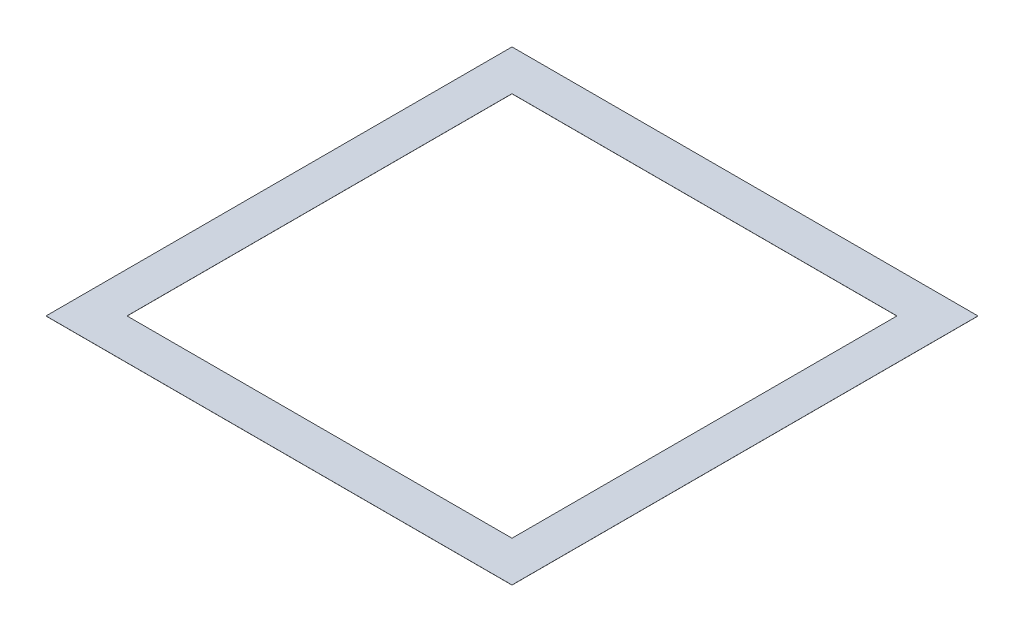
ISO-10303-21;
HEADER;
FILE_DESCRIPTION(('STEP AP214'),'2;1');
FILE_NAME('part.step','',(''),(''),'','','');
FILE_SCHEMA(('AUTOMOTIVE_DESIGN { 1 0 10303 214 1 1 1 1 }'));
ENDSEC;
DATA;
#1=APPLICATION_CONTEXT('core data for automotive mechanical design processes');
#2=APPLICATION_PROTOCOL_DEFINITION('international standard','automotive_design',2000,#1);
#3=PRODUCT_CONTEXT('',#1,'mechanical');
#4=PRODUCT('Part','Part','',(#3));
#5=PRODUCT_RELATED_PRODUCT_CATEGORY('part','',(#4));
#6=PRODUCT_DEFINITION_FORMATION('','',#4);
#7=PRODUCT_DEFINITION_CONTEXT('part definition',#1,'design');
#8=PRODUCT_DEFINITION('design','',#6,#7);
#9=PRODUCT_DEFINITION_SHAPE('','',#8);
#10=(LENGTH_UNIT() NAMED_UNIT(*) SI_UNIT(.MILLI.,.METRE.));
#11=(NAMED_UNIT(*) PLANE_ANGLE_UNIT() SI_UNIT($,.RADIAN.));
#12=(NAMED_UNIT(*) SI_UNIT($,.STERADIAN.) SOLID_ANGLE_UNIT());
#13=UNCERTAINTY_MEASURE_WITH_UNIT(LENGTH_MEASURE(1.E-05),#10,'distance_accuracy_value','');
#14=(GEOMETRIC_REPRESENTATION_CONTEXT(3) GLOBAL_UNCERTAINTY_ASSIGNED_CONTEXT((#13)) GLOBAL_UNIT_ASSIGNED_CONTEXT((#10,
#11,#12)) REPRESENTATION_CONTEXT('',''));
#15=CARTESIAN_POINT('',(0.,0.,0.));
#16=DIRECTION('',(0.,0.,1.));
#17=DIRECTION('',(1.,0.,0.));
#18=AXIS2_PLACEMENT_3D('',#15,#16,#17);
#19=CARTESIAN_POINT('',(0.,0.,0.));
#20=DIRECTION('',(0.,1.,0.));
#21=DIRECTION('',(0.,0.,1.));
#22=AXIS2_PLACEMENT_3D('',#19,#20,#21);
#23=PLANE('',#22);
#24=DIRECTION('',(1.,0.,0.));
#25=VECTOR('',#24,1.);
#26=CARTESIAN_POINT('',(241.3,0.,-241.3));
#27=LINE('',#26,#25);
#28=CARTESIAN_POINT('',(-241.3,0.,-241.3));
#29=VERTEX_POINT('',#28);
#30=CARTESIAN_POINT('',(241.3,0.,-241.3));
#31=VERTEX_POINT('',#30);
#32=EDGE_CURVE('E109',#29,#31,#27,.T.);
#33=ORIENTED_EDGE('',*,*,#32,.F.);
#34=DIRECTION('',(0.,0.,-1.));
#35=VECTOR('',#34,1.);
#36=CARTESIAN_POINT('',(-241.3,0.,241.3));
#37=LINE('',#36,#35);
#38=CARTESIAN_POINT('',(-241.3,0.,241.3));
#39=VERTEX_POINT('',#38);
#40=EDGE_CURVE('E123',#39,#29,#37,.T.);
#41=ORIENTED_EDGE('',*,*,#40,.F.);
#42=DIRECTION('',(-1.,0.,0.));
#43=VECTOR('',#42,1.);
#44=CARTESIAN_POINT('',(241.3,0.,241.3));
#45=LINE('',#44,#43);
#46=CARTESIAN_POINT('',(241.3,0.,241.3));
#47=VERTEX_POINT('',#46);
#48=EDGE_CURVE('E118',#47,#39,#45,.T.);
#49=ORIENTED_EDGE('',*,*,#48,.F.);
#50=DIRECTION('',(0.,0.,1.));
#51=VECTOR('',#50,1.);
#52=CARTESIAN_POINT('',(241.3,0.,241.3));
#53=LINE('',#52,#51);
#54=EDGE_CURVE('E112',#31,#47,#53,.T.);
#55=ORIENTED_EDGE('',*,*,#54,.F.);
#56=EDGE_LOOP('',(#33,#41,#49,#55));
#57=FACE_BOUND('',#56,.T.);
#58=DIRECTION('',(1.,0.,0.));
#59=VECTOR('',#58,1.);
#60=CARTESIAN_POINT('',(292.1,0.,-292.1));
#61=LINE('',#60,#59);
#62=CARTESIAN_POINT('',(-292.1,0.,-292.1));
#63=VERTEX_POINT('',#62);
#64=CARTESIAN_POINT('',(292.1,0.,-292.1));
#65=VERTEX_POINT('',#64);
#66=EDGE_CURVE('E107',#63,#65,#61,.T.);
#67=ORIENTED_EDGE('',*,*,#66,.T.);
#68=DIRECTION('',(0.,0.,1.));
#69=VECTOR('',#68,1.);
#70=CARTESIAN_POINT('',(292.1,0.,292.1));
#71=LINE('',#70,#69);
#72=CARTESIAN_POINT('',(292.1,0.,292.1));
#73=VERTEX_POINT('',#72);
#74=EDGE_CURVE('E93',#65,#73,#71,.T.);
#75=ORIENTED_EDGE('',*,*,#74,.T.);
#76=DIRECTION('',(-1.,0.,0.));
#77=VECTOR('',#76,1.);
#78=CARTESIAN_POINT('',(292.1,0.,292.1));
#79=LINE('',#78,#77);
#80=CARTESIAN_POINT('',(-292.1,0.,292.1));
#81=VERTEX_POINT('',#80);
#82=EDGE_CURVE('E80',#73,#81,#79,.T.);
#83=ORIENTED_EDGE('',*,*,#82,.T.);
#84=DIRECTION('',(0.,0.,-1.));
#85=VECTOR('',#84,1.);
#86=CARTESIAN_POINT('',(-292.1,0.,292.1));
#87=LINE('',#86,#85);
#88=EDGE_CURVE('E20',#81,#63,#87,.T.);
#89=ORIENTED_EDGE('',*,*,#88,.T.);
#90=EDGE_LOOP('',(#67,#75,#83,#89));
#91=FACE_BOUND('',#90,.T.);
#92=ADVANCED_FACE('F17',(#57,#91),#23,.F.);
#93=CARTESIAN_POINT('',(-292.1,0.127,292.1));
#94=DIRECTION('',(1.,0.,0.));
#95=DIRECTION('',(0.,0.,-1.));
#96=AXIS2_PLACEMENT_3D('',#93,#94,#95);
#97=PLANE('',#96);
#98=DIRECTION('',(0.,1.,0.));
#99=VECTOR('',#98,1.);
#100=CARTESIAN_POINT('',(-292.1,0.127,292.1));
#101=LINE('',#100,#99);
#102=CARTESIAN_POINT('',(-292.1,0.127,292.1));
#103=VERTEX_POINT('',#102);
#104=EDGE_CURVE('E86',#81,#103,#101,.T.);
#105=ORIENTED_EDGE('',*,*,#104,.T.);
#106=DIRECTION('',(0.,0.,1.));
#107=VECTOR('',#106,1.);
#108=CARTESIAN_POINT('',(-292.1,0.127,0.));
#109=LINE('',#108,#107);
#110=CARTESIAN_POINT('',(-292.1,0.127,-292.1));
#111=VERTEX_POINT('',#110);
#112=EDGE_CURVE('E130',#111,#103,#109,.T.);
#113=ORIENTED_EDGE('',*,*,#112,.F.);
#114=DIRECTION('',(0.,1.,0.));
#115=VECTOR('',#114,1.);
#116=CARTESIAN_POINT('',(-292.1,0.127,-292.1));
#117=LINE('',#116,#115);
#118=EDGE_CURVE('E89',#111,#63,#117,.F.);
#119=ORIENTED_EDGE('',*,*,#118,.T.);
#120=ORIENTED_EDGE('',*,*,#88,.F.);
#121=EDGE_LOOP('',(#105,#113,#119,#120));
#122=FACE_BOUND('',#121,.T.);
#123=ADVANCED_FACE('F85',(#122),#97,.F.);
#124=CARTESIAN_POINT('',(292.1,0.127,292.1));
#125=DIRECTION('',(0.,0.,-1.));
#126=DIRECTION('',(-1.,0.,0.));
#127=AXIS2_PLACEMENT_3D('',#124,#125,#126);
#128=PLANE('',#127);
#129=DIRECTION('',(0.,1.,0.));
#130=VECTOR('',#129,1.);
#131=CARTESIAN_POINT('',(292.1,0.127,292.1));
#132=LINE('',#131,#130);
#133=CARTESIAN_POINT('',(292.1,0.127,292.1));
#134=VERTEX_POINT('',#133);
#135=EDGE_CURVE('E95',#73,#134,#132,.T.);
#136=ORIENTED_EDGE('',*,*,#135,.T.);
#137=DIRECTION('',(1.,0.,0.));
#138=VECTOR('',#137,1.);
#139=CARTESIAN_POINT('',(0.,0.127,292.1));
#140=LINE('',#139,#138);
#141=EDGE_CURVE('E99',#103,#134,#140,.T.);
#142=ORIENTED_EDGE('',*,*,#141,.F.);
#143=ORIENTED_EDGE('',*,*,#104,.F.);
#144=ORIENTED_EDGE('',*,*,#82,.F.);
#145=EDGE_LOOP('',(#136,#142,#143,#144));
#146=FACE_BOUND('',#145,.T.);
#147=ADVANCED_FACE('F97',(#146),#128,.F.);
#148=CARTESIAN_POINT('',(292.1,0.127,292.1));
#149=DIRECTION('',(-1.,0.,0.));
#150=DIRECTION('',(0.,0.,1.));
#151=AXIS2_PLACEMENT_3D('',#148,#149,#150);
#152=PLANE('',#151);
#153=DIRECTION('',(0.,1.,0.));
#154=VECTOR('',#153,1.);
#155=CARTESIAN_POINT('',(292.1,0.127,-292.1));
#156=LINE('',#155,#154);
#157=CARTESIAN_POINT('',(292.1,0.127,-292.1));
#158=VERTEX_POINT('',#157);
#159=EDGE_CURVE('E104',#65,#158,#156,.T.);
#160=ORIENTED_EDGE('',*,*,#159,.T.);
#161=DIRECTION('',(0.,0.,1.));
#162=VECTOR('',#161,1.);
#163=CARTESIAN_POINT('',(292.1,0.127,0.));
#164=LINE('',#163,#162);
#165=EDGE_CURVE('E133',#134,#158,#164,.F.);
#166=ORIENTED_EDGE('',*,*,#165,.F.);
#167=ORIENTED_EDGE('',*,*,#135,.F.);
#168=ORIENTED_EDGE('',*,*,#74,.F.);
#169=EDGE_LOOP('',(#160,#166,#167,#168));
#170=FACE_BOUND('',#169,.T.);
#171=ADVANCED_FACE('F176',(#170),#152,.F.);
#172=CARTESIAN_POINT('',(292.1,0.127,-292.1));
#173=DIRECTION('',(0.,0.,1.));
#174=DIRECTION('',(1.,0.,0.));
#175=AXIS2_PLACEMENT_3D('',#172,#173,#174);
#176=PLANE('',#175);
#177=ORIENTED_EDGE('',*,*,#118,.F.);
#178=DIRECTION('',(1.,0.,0.));
#179=VECTOR('',#178,1.);
#180=CARTESIAN_POINT('',(0.,0.127,-292.1));
#181=LINE('',#180,#179);
#182=EDGE_CURVE('E136',#158,#111,#181,.F.);
#183=ORIENTED_EDGE('',*,*,#182,.F.);
#184=ORIENTED_EDGE('',*,*,#159,.F.);
#185=ORIENTED_EDGE('',*,*,#66,.F.);
#186=EDGE_LOOP('',(#177,#183,#184,#185));
#187=FACE_BOUND('',#186,.T.);
#188=ADVANCED_FACE('F173',(#187),#176,.F.);
#189=CARTESIAN_POINT('',(241.3,0.127,-241.3));
#190=DIRECTION('',(0.,0.,1.));
#191=DIRECTION('',(1.,0.,0.));
#192=AXIS2_PLACEMENT_3D('',#189,#190,#191);
#193=PLANE('',#192);
#194=DIRECTION('',(1.,0.,0.));
#195=VECTOR('',#194,1.);
#196=CARTESIAN_POINT('',(0.,0.127,-241.3));
#197=LINE('',#196,#195);
#198=CARTESIAN_POINT('',(-241.3,0.127,-241.3));
#199=VERTEX_POINT('',#198);
#200=CARTESIAN_POINT('',(241.3,0.127,-241.3));
#201=VERTEX_POINT('',#200);
#202=EDGE_CURVE('E139',#199,#201,#197,.T.);
#203=ORIENTED_EDGE('',*,*,#202,.F.);
#204=DIRECTION('',(0.,1.,0.));
#205=VECTOR('',#204,1.);
#206=CARTESIAN_POINT('',(-241.3,0.127,-241.3));
#207=LINE('',#206,#205);
#208=EDGE_CURVE('E126',#29,#199,#207,.T.);
#209=ORIENTED_EDGE('',*,*,#208,.F.);
#210=ORIENTED_EDGE('',*,*,#32,.T.);
#211=DIRECTION('',(0.,1.,0.));
#212=VECTOR('',#211,1.);
#213=CARTESIAN_POINT('',(241.3,0.127,-241.3));
#214=LINE('',#213,#212);
#215=EDGE_CURVE('E115',#201,#31,#214,.F.);
#216=ORIENTED_EDGE('',*,*,#215,.F.);
#217=EDGE_LOOP('',(#203,#209,#210,#216));
#218=FACE_BOUND('',#217,.T.);
#219=ADVANCED_FACE('F156',(#218),#193,.T.);
#220=CARTESIAN_POINT('',(241.3,0.127,241.3));
#221=DIRECTION('',(-1.,0.,0.));
#222=DIRECTION('',(0.,0.,1.));
#223=AXIS2_PLACEMENT_3D('',#220,#221,#222);
#224=PLANE('',#223);
#225=DIRECTION('',(0.,0.,1.));
#226=VECTOR('',#225,1.);
#227=CARTESIAN_POINT('',(241.3,0.127,0.));
#228=LINE('',#227,#226);
#229=CARTESIAN_POINT('',(241.3,0.127,241.3));
#230=VERTEX_POINT('',#229);
#231=EDGE_CURVE('E142',#201,#230,#228,.T.);
#232=ORIENTED_EDGE('',*,*,#231,.F.);
#233=ORIENTED_EDGE('',*,*,#215,.T.);
#234=ORIENTED_EDGE('',*,*,#54,.T.);
#235=DIRECTION('',(0.,1.,0.));
#236=VECTOR('',#235,1.);
#237=CARTESIAN_POINT('',(241.3,0.127,241.3));
#238=LINE('',#237,#236);
#239=EDGE_CURVE('E120',#230,#47,#238,.F.);
#240=ORIENTED_EDGE('',*,*,#239,.F.);
#241=EDGE_LOOP('',(#232,#233,#234,#240));
#242=FACE_BOUND('',#241,.T.);
#243=ADVANCED_FACE('F152',(#242),#224,.T.);
#244=CARTESIAN_POINT('',(241.3,0.127,241.3));
#245=DIRECTION('',(0.,0.,-1.));
#246=DIRECTION('',(-1.,0.,0.));
#247=AXIS2_PLACEMENT_3D('',#244,#245,#246);
#248=PLANE('',#247);
#249=DIRECTION('',(1.,0.,0.));
#250=VECTOR('',#249,1.);
#251=CARTESIAN_POINT('',(0.,0.127,241.3));
#252=LINE('',#251,#250);
#253=CARTESIAN_POINT('',(-241.3,0.127,241.3));
#254=VERTEX_POINT('',#253);
#255=EDGE_CURVE('E26',#230,#254,#252,.F.);
#256=ORIENTED_EDGE('',*,*,#255,.F.);
#257=ORIENTED_EDGE('',*,*,#239,.T.);
#258=ORIENTED_EDGE('',*,*,#48,.T.);
#259=DIRECTION('',(0.,1.,0.));
#260=VECTOR('',#259,1.);
#261=CARTESIAN_POINT('',(-241.3,0.127,241.3));
#262=LINE('',#261,#260);
#263=EDGE_CURVE('E35',#254,#39,#262,.F.);
#264=ORIENTED_EDGE('',*,*,#263,.F.);
#265=EDGE_LOOP('',(#256,#257,#258,#264));
#266=FACE_BOUND('',#265,.T.);
#267=ADVANCED_FACE('F150',(#266),#248,.T.);
#268=CARTESIAN_POINT('',(-241.3,0.127,241.3));
#269=DIRECTION('',(1.,0.,0.));
#270=DIRECTION('',(0.,0.,-1.));
#271=AXIS2_PLACEMENT_3D('',#268,#269,#270);
#272=PLANE('',#271);
#273=DIRECTION('',(0.,0.,1.));
#274=VECTOR('',#273,1.);
#275=CARTESIAN_POINT('',(-241.3,0.127,0.));
#276=LINE('',#275,#274);
#277=EDGE_CURVE('E11',#254,#199,#276,.F.);
#278=ORIENTED_EDGE('',*,*,#277,.F.);
#279=ORIENTED_EDGE('',*,*,#263,.T.);
#280=ORIENTED_EDGE('',*,*,#40,.T.);
#281=ORIENTED_EDGE('',*,*,#208,.T.);
#282=EDGE_LOOP('',(#278,#279,#280,#281));
#283=FACE_BOUND('',#282,.T.);
#284=ADVANCED_FACE('F158',(#283),#272,.T.);
#285=CARTESIAN_POINT('',(0.,0.127,0.));
#286=DIRECTION('',(0.,1.,0.));
#287=DIRECTION('',(0.,0.,1.));
#288=AXIS2_PLACEMENT_3D('',#285,#286,#287);
#289=PLANE('',#288);
#290=ORIENTED_EDGE('',*,*,#255,.T.);
#291=ORIENTED_EDGE('',*,*,#277,.T.);
#292=ORIENTED_EDGE('',*,*,#202,.T.);
#293=ORIENTED_EDGE('',*,*,#231,.T.);
#294=EDGE_LOOP('',(#290,#291,#292,#293));
#295=FACE_BOUND('',#294,.T.);
#296=ORIENTED_EDGE('',*,*,#165,.T.);
#297=ORIENTED_EDGE('',*,*,#182,.T.);
#298=ORIENTED_EDGE('',*,*,#112,.T.);
#299=ORIENTED_EDGE('',*,*,#141,.T.);
#300=EDGE_LOOP('',(#296,#297,#298,#299));
#301=FACE_BOUND('',#300,.T.);
#302=ADVANCED_FACE('F147',(#295,#301),#289,.T.);
#303=CLOSED_SHELL('',(#92,#123,#147,#171,#188,#219,#243,#267,#284,#302));
#304=MANIFOLD_SOLID_BREP('B1',#303);
#305=ADVANCED_BREP_SHAPE_REPRESENTATION('',(#18,#304),#14);
#306=SHAPE_DEFINITION_REPRESENTATION(#9,#305);
ENDSEC;
END-ISO-10303-21;
